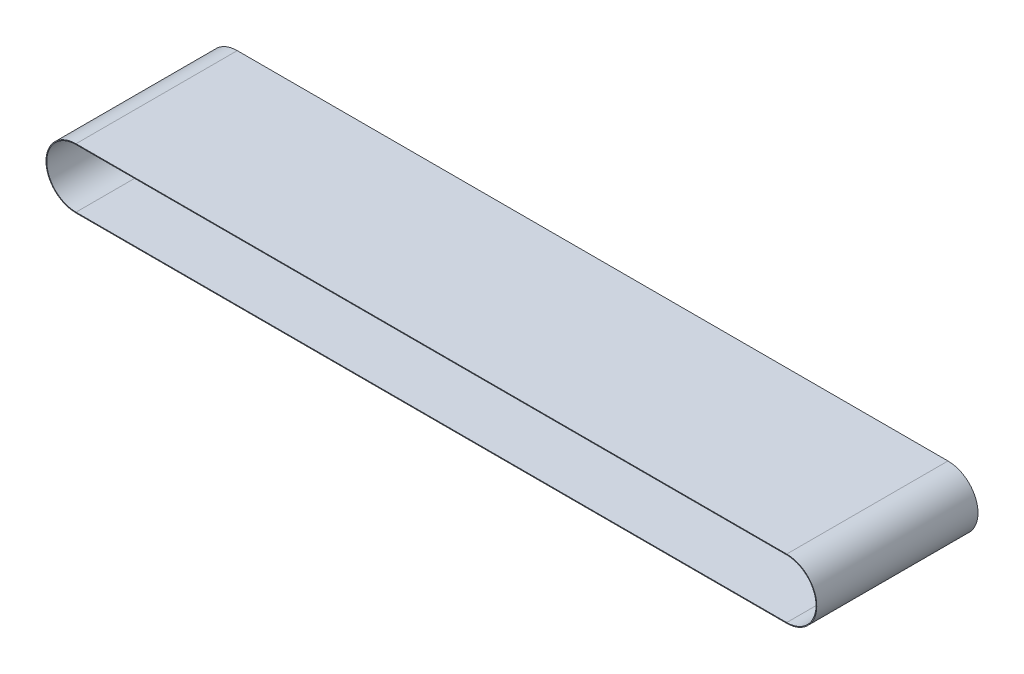
ISO-10303-21;
HEADER;
FILE_DESCRIPTION(('STEP AP214'),'2;1');
FILE_NAME('part.step','',(''),(''),'','','');
FILE_SCHEMA(('AUTOMOTIVE_DESIGN { 1 0 10303 214 1 1 1 1 }'));
ENDSEC;
DATA;
#1=APPLICATION_CONTEXT('core data for automotive mechanical design processes');
#2=APPLICATION_PROTOCOL_DEFINITION('international standard','automotive_design',2000,#1);
#3=PRODUCT_CONTEXT('',#1,'mechanical');
#4=PRODUCT('Part','Part','',(#3));
#5=PRODUCT_RELATED_PRODUCT_CATEGORY('part','',(#4));
#6=PRODUCT_DEFINITION_FORMATION('','',#4);
#7=PRODUCT_DEFINITION_CONTEXT('part definition',#1,'design');
#8=PRODUCT_DEFINITION('design','',#6,#7);
#9=PRODUCT_DEFINITION_SHAPE('','',#8);
#10=(LENGTH_UNIT() NAMED_UNIT(*) SI_UNIT(.MILLI.,.METRE.));
#11=(NAMED_UNIT(*) PLANE_ANGLE_UNIT() SI_UNIT($,.RADIAN.));
#12=(NAMED_UNIT(*) SI_UNIT($,.STERADIAN.) SOLID_ANGLE_UNIT());
#13=UNCERTAINTY_MEASURE_WITH_UNIT(LENGTH_MEASURE(1.E-05),#10,'distance_accuracy_value','');
#14=(GEOMETRIC_REPRESENTATION_CONTEXT(3) GLOBAL_UNCERTAINTY_ASSIGNED_CONTEXT((#13)) GLOBAL_UNIT_ASSIGNED_CONTEXT((#10,
#11,#12)) REPRESENTATION_CONTEXT('',''));
#15=CARTESIAN_POINT('',(0.,0.,0.));
#16=DIRECTION('',(0.,0.,1.));
#17=DIRECTION('',(1.,0.,0.));
#18=AXIS2_PLACEMENT_3D('',#15,#16,#17);
#19=CARTESIAN_POINT('',(-167.5,0.,76.));
#20=DIRECTION('',(0.,0.,1.));
#21=DIRECTION('',(1.,0.,0.));
#22=AXIS2_PLACEMENT_3D('',#19,#20,#21);
#23=PLANE('',#22);
#24=CARTESIAN_POINT('',(-167.5,0.,76.));
#25=DIRECTION('',(0.,0.,1.));
#26=DIRECTION('',(1.,0.,0.));
#27=AXIS2_PLACEMENT_3D('',#24,#25,#26);
#28=CIRCLE('',#27,14.15);
#29=CARTESIAN_POINT('',(-167.5,14.15,76.));
#30=VERTEX_POINT('',#29);
#31=CARTESIAN_POINT('',(-167.5,-14.15,76.));
#32=VERTEX_POINT('',#31);
#33=EDGE_CURVE('E155',#30,#32,#28,.T.);
#34=ORIENTED_EDGE('',*,*,#33,.T.);
#35=DIRECTION('',(1.,0.,0.));
#36=VECTOR('',#35,1.);
#37=CARTESIAN_POINT('',(-167.5,-14.15,76.));
#38=LINE('',#37,#36);
#39=CARTESIAN_POINT('',(167.5,-14.15,76.));
#40=VERTEX_POINT('',#39);
#41=EDGE_CURVE('E159',#32,#40,#38,.T.);
#42=ORIENTED_EDGE('',*,*,#41,.T.);
#43=CARTESIAN_POINT('',(167.5,0.,76.));
#44=DIRECTION('',(0.,0.,1.));
#45=DIRECTION('',(1.,0.,0.));
#46=AXIS2_PLACEMENT_3D('',#43,#44,#45);
#47=CIRCLE('',#46,14.15);
#48=CARTESIAN_POINT('',(167.5,14.15,76.));
#49=VERTEX_POINT('',#48);
#50=EDGE_CURVE('E163',#40,#49,#47,.T.);
#51=ORIENTED_EDGE('',*,*,#50,.T.);
#52=DIRECTION('',(-1.,0.,0.));
#53=VECTOR('',#52,1.);
#54=CARTESIAN_POINT('',(-167.5,14.15,76.));
#55=LINE('',#54,#53);
#56=EDGE_CURVE('E166',#49,#30,#55,.T.);
#57=ORIENTED_EDGE('',*,*,#56,.T.);
#58=EDGE_LOOP('',(#34,#42,#51,#57));
#59=FACE_BOUND('',#58,.T.);
#60=DIRECTION('',(1.,0.,0.));
#61=VECTOR('',#60,1.);
#62=CARTESIAN_POINT('',(-167.5,-13.8,76.));
#63=LINE('',#62,#61);
#64=CARTESIAN_POINT('',(-167.5,-13.8,76.));
#65=VERTEX_POINT('',#64);
#66=CARTESIAN_POINT('',(167.5,-13.8,76.));
#67=VERTEX_POINT('',#66);
#68=EDGE_CURVE('E115',#65,#67,#63,.T.);
#69=ORIENTED_EDGE('',*,*,#68,.F.);
#70=CARTESIAN_POINT('',(-167.5,0.,76.));
#71=DIRECTION('',(0.,0.,1.));
#72=DIRECTION('',(1.,0.,0.));
#73=AXIS2_PLACEMENT_3D('',#70,#71,#72);
#74=CIRCLE('',#73,13.8);
#75=CARTESIAN_POINT('',(-167.5,13.8,76.));
#76=VERTEX_POINT('',#75);
#77=EDGE_CURVE('E106',#76,#65,#74,.T.);
#78=ORIENTED_EDGE('',*,*,#77,.F.);
#79=DIRECTION('',(-1.,0.,0.));
#80=VECTOR('',#79,1.);
#81=CARTESIAN_POINT('',(-167.5,13.8,76.));
#82=LINE('',#81,#80);
#83=CARTESIAN_POINT('',(167.5,13.8,76.));
#84=VERTEX_POINT('',#83);
#85=EDGE_CURVE('E133',#84,#76,#82,.T.);
#86=ORIENTED_EDGE('',*,*,#85,.F.);
#87=CARTESIAN_POINT('',(167.5,0.,76.));
#88=DIRECTION('',(0.,0.,1.));
#89=DIRECTION('',(1.,0.,0.));
#90=AXIS2_PLACEMENT_3D('',#87,#88,#89);
#91=CIRCLE('',#90,13.8);
#92=EDGE_CURVE('E128',#67,#84,#91,.T.);
#93=ORIENTED_EDGE('',*,*,#92,.F.);
#94=EDGE_LOOP('',(#69,#78,#86,#93));
#95=FACE_BOUND('',#94,.T.);
#96=ADVANCED_FACE('F40',(#59,#95),#23,.T.);
#97=CARTESIAN_POINT('',(-167.5,0.,0.));
#98=DIRECTION('',(0.,0.,1.));
#99=DIRECTION('',(1.,0.,0.));
#100=AXIS2_PLACEMENT_3D('',#97,#98,#99);
#101=PLANE('',#100);
#102=CARTESIAN_POINT('',(-167.5,0.,0.));
#103=DIRECTION('',(0.,0.,1.));
#104=DIRECTION('',(1.,0.,0.));
#105=AXIS2_PLACEMENT_3D('',#102,#103,#104);
#106=CIRCLE('',#105,14.15);
#107=CARTESIAN_POINT('',(-167.5,14.15,0.));
#108=VERTEX_POINT('',#107);
#109=CARTESIAN_POINT('',(-167.5,-14.15,0.));
#110=VERTEX_POINT('',#109);
#111=EDGE_CURVE('E124',#108,#110,#106,.T.);
#112=ORIENTED_EDGE('',*,*,#111,.F.);
#113=DIRECTION('',(-1.,0.,0.));
#114=VECTOR('',#113,1.);
#115=CARTESIAN_POINT('',(-167.5,14.15,0.));
#116=LINE('',#115,#114);
#117=CARTESIAN_POINT('',(167.5,14.15,0.));
#118=VERTEX_POINT('',#117);
#119=EDGE_CURVE('E160',#118,#108,#116,.T.);
#120=ORIENTED_EDGE('',*,*,#119,.F.);
#121=CARTESIAN_POINT('',(167.5,0.,0.));
#122=DIRECTION('',(0.,0.,1.));
#123=DIRECTION('',(1.,0.,0.));
#124=AXIS2_PLACEMENT_3D('',#121,#122,#123);
#125=CIRCLE('',#124,14.15);
#126=CARTESIAN_POINT('',(167.5,-14.15,0.));
#127=VERTEX_POINT('',#126);
#128=EDGE_CURVE('E176',#127,#118,#125,.T.);
#129=ORIENTED_EDGE('',*,*,#128,.F.);
#130=DIRECTION('',(1.,0.,0.));
#131=VECTOR('',#130,1.);
#132=CARTESIAN_POINT('',(-167.5,-14.15,0.));
#133=LINE('',#132,#131);
#134=EDGE_CURVE('E173',#110,#127,#133,.T.);
#135=ORIENTED_EDGE('',*,*,#134,.F.);
#136=EDGE_LOOP('',(#112,#120,#129,#135));
#137=FACE_BOUND('',#136,.T.);
#138=CARTESIAN_POINT('',(-167.5,0.,0.));
#139=DIRECTION('',(0.,0.,1.));
#140=DIRECTION('',(1.,0.,0.));
#141=AXIS2_PLACEMENT_3D('',#138,#139,#140);
#142=CIRCLE('',#141,13.8);
#143=CARTESIAN_POINT('',(-167.5,13.8,0.));
#144=VERTEX_POINT('',#143);
#145=CARTESIAN_POINT('',(-167.5,-13.8,0.));
#146=VERTEX_POINT('',#145);
#147=EDGE_CURVE('E64',#144,#146,#142,.T.);
#148=ORIENTED_EDGE('',*,*,#147,.T.);
#149=DIRECTION('',(1.,0.,0.));
#150=VECTOR('',#149,1.);
#151=CARTESIAN_POINT('',(-167.5,-13.8,0.));
#152=LINE('',#151,#150);
#153=CARTESIAN_POINT('',(167.5,-13.8,0.));
#154=VERTEX_POINT('',#153);
#155=EDGE_CURVE('E122',#146,#154,#152,.T.);
#156=ORIENTED_EDGE('',*,*,#155,.T.);
#157=CARTESIAN_POINT('',(167.5,0.,0.));
#158=DIRECTION('',(0.,0.,1.));
#159=DIRECTION('',(1.,0.,0.));
#160=AXIS2_PLACEMENT_3D('',#157,#158,#159);
#161=CIRCLE('',#160,13.8);
#162=CARTESIAN_POINT('',(167.5,13.8,0.));
#163=VERTEX_POINT('',#162);
#164=EDGE_CURVE('E142',#154,#163,#161,.T.);
#165=ORIENTED_EDGE('',*,*,#164,.T.);
#166=DIRECTION('',(-1.,0.,0.));
#167=VECTOR('',#166,1.);
#168=CARTESIAN_POINT('',(-167.5,13.8,0.));
#169=LINE('',#168,#167);
#170=EDGE_CURVE('E116',#163,#144,#169,.T.);
#171=ORIENTED_EDGE('',*,*,#170,.T.);
#172=EDGE_LOOP('',(#148,#156,#165,#171));
#173=FACE_BOUND('',#172,.T.);
#174=ADVANCED_FACE('F200',(#137,#173),#101,.F.);
#175=CARTESIAN_POINT('',(-167.5,0.,76.));
#176=DIRECTION('',(0.,0.,-1.));
#177=DIRECTION('',(-1.,0.,0.));
#178=AXIS2_PLACEMENT_3D('',#175,#176,#177);
#179=CYLINDRICAL_SURFACE('',#178,14.15);
#180=ORIENTED_EDGE('',*,*,#111,.T.);
#181=DIRECTION('',(0.,0.,-1.));
#182=VECTOR('',#181,1.);
#183=CARTESIAN_POINT('',(-167.5,-14.15,76.));
#184=LINE('',#183,#182);
#185=EDGE_CURVE('E11',#32,#110,#184,.T.);
#186=ORIENTED_EDGE('',*,*,#185,.F.);
#187=ORIENTED_EDGE('',*,*,#33,.F.);
#188=DIRECTION('',(0.,0.,-1.));
#189=VECTOR('',#188,1.);
#190=CARTESIAN_POINT('',(-167.5,14.15,76.));
#191=LINE('',#190,#189);
#192=EDGE_CURVE('E169',#30,#108,#191,.T.);
#193=ORIENTED_EDGE('',*,*,#192,.T.);
#194=EDGE_LOOP('',(#180,#186,#187,#193));
#195=FACE_BOUND('',#194,.T.);
#196=ADVANCED_FACE('F42',(#195),#179,.T.);
#197=CARTESIAN_POINT('',(-167.5,-14.15,76.));
#198=DIRECTION('',(0.,1.,0.));
#199=DIRECTION('',(0.,0.,1.));
#200=AXIS2_PLACEMENT_3D('',#197,#198,#199);
#201=PLANE('',#200);
#202=ORIENTED_EDGE('',*,*,#134,.T.);
#203=DIRECTION('',(0.,0.,-1.));
#204=VECTOR('',#203,1.);
#205=CARTESIAN_POINT('',(167.5,-14.15,76.));
#206=LINE('',#205,#204);
#207=EDGE_CURVE('E49',#40,#127,#206,.T.);
#208=ORIENTED_EDGE('',*,*,#207,.F.);
#209=ORIENTED_EDGE('',*,*,#41,.F.);
#210=ORIENTED_EDGE('',*,*,#185,.T.);
#211=EDGE_LOOP('',(#202,#208,#209,#210));
#212=FACE_BOUND('',#211,.T.);
#213=ADVANCED_FACE('F210',(#212),#201,.F.);
#214=CARTESIAN_POINT('',(167.5,0.,76.));
#215=DIRECTION('',(0.,0.,-1.));
#216=DIRECTION('',(-1.,0.,0.));
#217=AXIS2_PLACEMENT_3D('',#214,#215,#216);
#218=CYLINDRICAL_SURFACE('',#217,14.15);
#219=ORIENTED_EDGE('',*,*,#128,.T.);
#220=DIRECTION('',(0.,0.,-1.));
#221=VECTOR('',#220,1.);
#222=CARTESIAN_POINT('',(167.5,14.15,76.));
#223=LINE('',#222,#221);
#224=EDGE_CURVE('E184',#49,#118,#223,.T.);
#225=ORIENTED_EDGE('',*,*,#224,.F.);
#226=ORIENTED_EDGE('',*,*,#50,.F.);
#227=ORIENTED_EDGE('',*,*,#207,.T.);
#228=EDGE_LOOP('',(#219,#225,#226,#227));
#229=FACE_BOUND('',#228,.T.);
#230=ADVANCED_FACE('F194',(#229),#218,.T.);
#231=CARTESIAN_POINT('',(-167.5,14.15,76.));
#232=DIRECTION('',(0.,-1.,0.));
#233=DIRECTION('',(0.,0.,-1.));
#234=AXIS2_PLACEMENT_3D('',#231,#232,#233);
#235=PLANE('',#234);
#236=ORIENTED_EDGE('',*,*,#119,.T.);
#237=ORIENTED_EDGE('',*,*,#192,.F.);
#238=ORIENTED_EDGE('',*,*,#56,.F.);
#239=ORIENTED_EDGE('',*,*,#224,.T.);
#240=EDGE_LOOP('',(#236,#237,#238,#239));
#241=FACE_BOUND('',#240,.T.);
#242=ADVANCED_FACE('F204',(#241),#235,.F.);
#243=CARTESIAN_POINT('',(-167.5,0.,76.));
#244=DIRECTION('',(0.,0.,-1.));
#245=DIRECTION('',(-1.,0.,0.));
#246=AXIS2_PLACEMENT_3D('',#243,#244,#245);
#247=CYLINDRICAL_SURFACE('',#246,13.8);
#248=ORIENTED_EDGE('',*,*,#147,.F.);
#249=DIRECTION('',(0.,0.,-1.));
#250=VECTOR('',#249,1.);
#251=CARTESIAN_POINT('',(-167.5,13.8,76.));
#252=LINE('',#251,#250);
#253=EDGE_CURVE('E110',#76,#144,#252,.T.);
#254=ORIENTED_EDGE('',*,*,#253,.F.);
#255=ORIENTED_EDGE('',*,*,#77,.T.);
#256=DIRECTION('',(0.,0.,-1.));
#257=VECTOR('',#256,1.);
#258=CARTESIAN_POINT('',(-167.5,-13.8,76.));
#259=LINE('',#258,#257);
#260=EDGE_CURVE('E109',#65,#146,#259,.T.);
#261=ORIENTED_EDGE('',*,*,#260,.T.);
#262=EDGE_LOOP('',(#248,#254,#255,#261));
#263=FACE_BOUND('',#262,.T.);
#264=ADVANCED_FACE('F108',(#263),#247,.F.);
#265=CARTESIAN_POINT('',(-167.5,-13.8,76.));
#266=DIRECTION('',(0.,1.,0.));
#267=DIRECTION('',(0.,0.,1.));
#268=AXIS2_PLACEMENT_3D('',#265,#266,#267);
#269=PLANE('',#268);
#270=ORIENTED_EDGE('',*,*,#155,.F.);
#271=ORIENTED_EDGE('',*,*,#260,.F.);
#272=ORIENTED_EDGE('',*,*,#68,.T.);
#273=DIRECTION('',(0.,0.,-1.));
#274=VECTOR('',#273,1.);
#275=CARTESIAN_POINT('',(167.5,-13.8,76.));
#276=LINE('',#275,#274);
#277=EDGE_CURVE('E125',#67,#154,#276,.T.);
#278=ORIENTED_EDGE('',*,*,#277,.T.);
#279=EDGE_LOOP('',(#270,#271,#272,#278));
#280=FACE_BOUND('',#279,.T.);
#281=ADVANCED_FACE('F119',(#280),#269,.T.);
#282=CARTESIAN_POINT('',(167.5,0.,76.));
#283=DIRECTION('',(0.,0.,-1.));
#284=DIRECTION('',(-1.,0.,0.));
#285=AXIS2_PLACEMENT_3D('',#282,#283,#284);
#286=CYLINDRICAL_SURFACE('',#285,13.8);
#287=ORIENTED_EDGE('',*,*,#164,.F.);
#288=ORIENTED_EDGE('',*,*,#277,.F.);
#289=ORIENTED_EDGE('',*,*,#92,.T.);
#290=DIRECTION('',(0.,0.,-1.));
#291=VECTOR('',#290,1.);
#292=CARTESIAN_POINT('',(167.5,13.8,76.));
#293=LINE('',#292,#291);
#294=EDGE_CURVE('E56',#84,#163,#293,.T.);
#295=ORIENTED_EDGE('',*,*,#294,.T.);
#296=EDGE_LOOP('',(#287,#288,#289,#295));
#297=FACE_BOUND('',#296,.T.);
#298=ADVANCED_FACE('F233',(#297),#286,.F.);
#299=CARTESIAN_POINT('',(-167.5,13.8,76.));
#300=DIRECTION('',(0.,-1.,0.));
#301=DIRECTION('',(0.,0.,-1.));
#302=AXIS2_PLACEMENT_3D('',#299,#300,#301);
#303=PLANE('',#302);
#304=ORIENTED_EDGE('',*,*,#170,.F.);
#305=ORIENTED_EDGE('',*,*,#294,.F.);
#306=ORIENTED_EDGE('',*,*,#85,.T.);
#307=ORIENTED_EDGE('',*,*,#253,.T.);
#308=EDGE_LOOP('',(#304,#305,#306,#307));
#309=FACE_BOUND('',#308,.T.);
#310=ADVANCED_FACE('F237',(#309),#303,.T.);
#311=CLOSED_SHELL('',(#96,#174,#196,#213,#230,#242,#264,#281,#298,#310));
#312=MANIFOLD_SOLID_BREP('B2',#311);
#313=ADVANCED_BREP_SHAPE_REPRESENTATION('',(#18,#312),#14);
#314=SHAPE_DEFINITION_REPRESENTATION(#9,#313);
ENDSEC;
END-ISO-10303-21;
